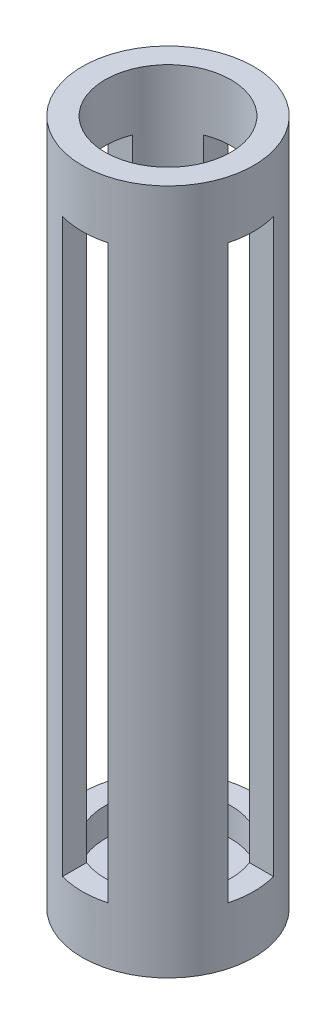
ISO-10303-21;
HEADER;
FILE_DESCRIPTION(('STEP AP214'),'2;1');
FILE_NAME('part.step','',(''),(''),'','','');
FILE_SCHEMA(('AUTOMOTIVE_DESIGN { 1 0 10303 214 1 1 1 1 }'));
ENDSEC;
DATA;
#1=APPLICATION_CONTEXT('core data for automotive mechanical design processes');
#2=APPLICATION_PROTOCOL_DEFINITION('international standard','automotive_design',2000,#1);
#3=PRODUCT_CONTEXT('',#1,'mechanical');
#4=PRODUCT('Part','Part','',(#3));
#5=PRODUCT_RELATED_PRODUCT_CATEGORY('part','',(#4));
#6=PRODUCT_DEFINITION_FORMATION('','',#4);
#7=PRODUCT_DEFINITION_CONTEXT('part definition',#1,'design');
#8=PRODUCT_DEFINITION('design','',#6,#7);
#9=PRODUCT_DEFINITION_SHAPE('','',#8);
#10=(LENGTH_UNIT() NAMED_UNIT(*) SI_UNIT(.MILLI.,.METRE.));
#11=(NAMED_UNIT(*) PLANE_ANGLE_UNIT() SI_UNIT($,.RADIAN.));
#12=(NAMED_UNIT(*) SI_UNIT($,.STERADIAN.) SOLID_ANGLE_UNIT());
#13=UNCERTAINTY_MEASURE_WITH_UNIT(LENGTH_MEASURE(1.E-05),#10,'distance_accuracy_value','');
#14=(GEOMETRIC_REPRESENTATION_CONTEXT(3) GLOBAL_UNCERTAINTY_ASSIGNED_CONTEXT((#13)) GLOBAL_UNIT_ASSIGNED_CONTEXT((#10,
#11,#12)) REPRESENTATION_CONTEXT('',''));
#15=CARTESIAN_POINT('',(0.,0.,0.));
#16=DIRECTION('',(0.,0.,1.));
#17=DIRECTION('',(1.,0.,0.));
#18=AXIS2_PLACEMENT_3D('',#15,#16,#17);
#19=CARTESIAN_POINT('',(0.,152.4,0.));
#20=DIRECTION('',(0.,-1.,0.));
#21=DIRECTION('',(0.,0.,-1.));
#22=AXIS2_PLACEMENT_3D('',#19,#20,#21);
#23=CYLINDRICAL_SURFACE('',#22,13.97);
#24=DIRECTION('',(0.,-1.,0.));
#25=VECTOR('',#24,1.);
#26=CARTESIAN_POINT('',(5.07999999999998,152.4,-13.0136274727687));
#27=LINE('',#26,#25);
#28=CARTESIAN_POINT('',(5.08000000000003,12.7,-13.0136274727687));
#29=VERTEX_POINT('',#28);
#30=CARTESIAN_POINT('',(5.07999999999998,139.7,-13.0136274727687));
#31=VERTEX_POINT('',#30);
#32=EDGE_CURVE('E11',#29,#31,#27,.F.);
#33=ORIENTED_EDGE('',*,*,#32,.F.);
#34=CARTESIAN_POINT('',(0.,12.7,0.));
#35=DIRECTION('',(0.,1.,0.));
#36=DIRECTION('',(-1.,0.,0.));
#37=AXIS2_PLACEMENT_3D('',#34,#35,#36);
#38=CIRCLE('',#37,13.97);
#39=CARTESIAN_POINT('',(-5.08000000000003,12.7,-13.0136274727687));
#40=VERTEX_POINT('',#39);
#41=EDGE_CURVE('E50',#29,#40,#38,.T.);
#42=ORIENTED_EDGE('',*,*,#41,.T.);
#43=DIRECTION('',(0.,-1.,0.));
#44=VECTOR('',#43,1.);
#45=CARTESIAN_POINT('',(-5.08000000000001,152.4,-13.0136274727687));
#46=LINE('',#45,#44);
#47=CARTESIAN_POINT('',(-5.08000000000001,139.7,-13.0136274727687));
#48=VERTEX_POINT('',#47);
#49=EDGE_CURVE('E444',#40,#48,#46,.F.);
#50=ORIENTED_EDGE('',*,*,#49,.T.);
#51=CARTESIAN_POINT('',(0.,139.7,0.));
#52=DIRECTION('',(0.,1.,0.));
#53=DIRECTION('',(0.,0.,1.));
#54=AXIS2_PLACEMENT_3D('',#51,#52,#53);
#55=CIRCLE('',#54,13.97);
#56=EDGE_CURVE('E434',#31,#48,#55,.T.);
#57=ORIENTED_EDGE('',*,*,#56,.F.);
#58=EDGE_LOOP('',(#33,#42,#50,#57));
#59=FACE_BOUND('',#58,.T.);
#60=DIRECTION('',(0.,-1.,0.));
#61=VECTOR('',#60,1.);
#62=CARTESIAN_POINT('',(5.07999999999998,152.4,13.0136274727687));
#63=LINE('',#62,#61);
#64=CARTESIAN_POINT('',(5.07999999999998,139.7,13.0136274727687));
#65=VERTEX_POINT('',#64);
#66=CARTESIAN_POINT('',(5.08000000000003,12.7,13.0136274727687));
#67=VERTEX_POINT('',#66);
#68=EDGE_CURVE('E442',#65,#67,#63,.T.);
#69=ORIENTED_EDGE('',*,*,#68,.F.);
#70=CARTESIAN_POINT('',(-5.08000000000001,139.7,13.0136274727687));
#71=VERTEX_POINT('',#70);
#72=EDGE_CURVE('E430',#71,#65,#55,.T.);
#73=ORIENTED_EDGE('',*,*,#72,.F.);
#74=DIRECTION('',(0.,-1.,0.));
#75=VECTOR('',#74,1.);
#76=CARTESIAN_POINT('',(-5.08000000000001,152.4,13.0136274727687));
#77=LINE('',#76,#75);
#78=CARTESIAN_POINT('',(-5.08000000000003,12.7,13.0136274727687));
#79=VERTEX_POINT('',#78);
#80=EDGE_CURVE('E433',#71,#79,#77,.T.);
#81=ORIENTED_EDGE('',*,*,#80,.T.);
#82=EDGE_CURVE('E438',#79,#67,#38,.T.);
#83=ORIENTED_EDGE('',*,*,#82,.T.);
#84=EDGE_LOOP('',(#69,#73,#81,#83));
#85=FACE_BOUND('',#84,.T.);
#86=DIRECTION('',(0.,-1.,0.));
#87=VECTOR('',#86,1.);
#88=CARTESIAN_POINT('',(13.0136274727687,152.4,-5.08));
#89=LINE('',#88,#87);
#90=CARTESIAN_POINT('',(13.0136274727687,139.7,-5.08));
#91=VERTEX_POINT('',#90);
#92=CARTESIAN_POINT('',(13.0136274727687,12.7,-5.08));
#93=VERTEX_POINT('',#92);
#94=EDGE_CURVE('E386',#91,#93,#89,.T.);
#95=ORIENTED_EDGE('',*,*,#94,.F.);
#96=CARTESIAN_POINT('',(0.,139.7,0.));
#97=DIRECTION('',(0.,1.,0.));
#98=DIRECTION('',(0.,0.,1.));
#99=AXIS2_PLACEMENT_3D('',#96,#97,#98);
#100=CIRCLE('',#99,13.97);
#101=CARTESIAN_POINT('',(13.0136274727687,139.7,5.08));
#102=VERTEX_POINT('',#101);
#103=EDGE_CURVE('E368',#102,#91,#100,.T.);
#104=ORIENTED_EDGE('',*,*,#103,.F.);
#105=DIRECTION('',(0.,-1.,0.));
#106=VECTOR('',#105,1.);
#107=CARTESIAN_POINT('',(13.0136274727687,152.4,5.08));
#108=LINE('',#107,#106);
#109=CARTESIAN_POINT('',(13.0136274727687,12.7,5.08));
#110=VERTEX_POINT('',#109);
#111=EDGE_CURVE('E373',#102,#110,#108,.T.);
#112=ORIENTED_EDGE('',*,*,#111,.T.);
#113=CARTESIAN_POINT('',(0.,12.7,0.));
#114=DIRECTION('',(0.,1.,0.));
#115=DIRECTION('',(0.,0.,1.));
#116=AXIS2_PLACEMENT_3D('',#113,#114,#115);
#117=CIRCLE('',#116,13.97);
#118=EDGE_CURVE('E381',#110,#93,#117,.T.);
#119=ORIENTED_EDGE('',*,*,#118,.T.);
#120=EDGE_LOOP('',(#95,#104,#112,#119));
#121=FACE_BOUND('',#120,.T.);
#122=DIRECTION('',(0.,-1.,0.));
#123=VECTOR('',#122,1.);
#124=CARTESIAN_POINT('',(-13.0136274727687,152.4,-5.08));
#125=LINE('',#124,#123);
#126=CARTESIAN_POINT('',(-13.0136274727687,12.7,-5.08));
#127=VERTEX_POINT('',#126);
#128=CARTESIAN_POINT('',(-13.0136274727687,139.7,-5.08));
#129=VERTEX_POINT('',#128);
#130=EDGE_CURVE('E382',#127,#129,#125,.F.);
#131=ORIENTED_EDGE('',*,*,#130,.F.);
#132=CARTESIAN_POINT('',(-13.0136274727687,12.7,5.08));
#133=VERTEX_POINT('',#132);
#134=EDGE_CURVE('E377',#127,#133,#117,.T.);
#135=ORIENTED_EDGE('',*,*,#134,.T.);
#136=DIRECTION('',(0.,-1.,0.));
#137=VECTOR('',#136,1.);
#138=CARTESIAN_POINT('',(-13.0136274727687,152.4,5.08));
#139=LINE('',#138,#137);
#140=CARTESIAN_POINT('',(-13.0136274727687,139.7,5.08));
#141=VERTEX_POINT('',#140);
#142=EDGE_CURVE('E369',#133,#141,#139,.F.);
#143=ORIENTED_EDGE('',*,*,#142,.T.);
#144=EDGE_CURVE('E365',#129,#141,#100,.T.);
#145=ORIENTED_EDGE('',*,*,#144,.F.);
#146=EDGE_LOOP('',(#131,#135,#143,#145));
#147=FACE_BOUND('',#146,.T.);
#148=CARTESIAN_POINT('',(0.,152.4,0.));
#149=DIRECTION('',(0.,1.,0.));
#150=DIRECTION('',(0.,0.,1.));
#151=AXIS2_PLACEMENT_3D('',#148,#149,#150);
#152=CIRCLE('',#151,13.97);
#153=CARTESIAN_POINT('',(0.,152.4,13.97));
#154=VERTEX_POINT('',#153);
#155=EDGE_CURVE('E393',#154,#154,#152,.T.);
#156=ORIENTED_EDGE('',*,*,#155,.T.);
#157=EDGE_LOOP('',(#156));
#158=FACE_BOUND('',#157,.T.);
#159=CARTESIAN_POINT('',(0.,6.35,0.));
#160=DIRECTION('',(0.,-1.,0.));
#161=DIRECTION('',(0.,0.,-1.));
#162=AXIS2_PLACEMENT_3D('',#159,#160,#161);
#163=CIRCLE('',#162,13.97);
#164=CARTESIAN_POINT('',(0.,6.35,-13.97));
#165=VERTEX_POINT('',#164);
#166=EDGE_CURVE('E389',#165,#165,#163,.T.);
#167=ORIENTED_EDGE('',*,*,#166,.T.);
#168=EDGE_LOOP('',(#167));
#169=FACE_BOUND('',#168,.T.);
#170=DIRECTION('',(0.,-1.,0.));
#171=VECTOR('',#170,1.);
#172=CARTESIAN_POINT('',(11.7877363247381,48.26,7.49734435239904));
#173=LINE('',#172,#171);
#174=CARTESIAN_POINT('',(11.7877363247381,48.26,7.49734435239904));
#175=VERTEX_POINT('',#174);
#176=CARTESIAN_POINT('',(11.7877363247381,45.72,7.49734435239904));
#177=VERTEX_POINT('',#176);
#178=EDGE_CURVE('E283',#175,#177,#173,.T.);
#179=ORIENTED_EDGE('',*,*,#178,.F.);
#180=CARTESIAN_POINT('',(0.,48.26,0.));
#181=DIRECTION('',(0.,-1.,0.));
#182=DIRECTION('',(0.,0.,-1.));
#183=AXIS2_PLACEMENT_3D('',#180,#181,#182);
#184=CIRCLE('',#183,13.97);
#185=CARTESIAN_POINT('',(6.08126850217283,48.26,12.5769262303824));
#186=VERTEX_POINT('',#185);
#187=EDGE_CURVE('E252',#175,#186,#184,.T.);
#188=ORIENTED_EDGE('',*,*,#187,.T.);
#189=DIRECTION('',(0.,-1.,0.));
#190=VECTOR('',#189,1.);
#191=CARTESIAN_POINT('',(6.08126850217283,48.26,12.5769262303824));
#192=LINE('',#191,#190);
#193=CARTESIAN_POINT('',(6.08126850217283,45.72,12.5769262303824));
#194=VERTEX_POINT('',#193);
#195=EDGE_CURVE('E268',#186,#194,#192,.T.);
#196=ORIENTED_EDGE('',*,*,#195,.T.);
#197=CARTESIAN_POINT('',(0.,45.72,0.));
#198=DIRECTION('',(0.,-1.,0.));
#199=DIRECTION('',(0.,0.,-1.));
#200=AXIS2_PLACEMENT_3D('',#197,#198,#199);
#201=CIRCLE('',#200,13.97);
#202=EDGE_CURVE('E247',#177,#194,#201,.T.);
#203=ORIENTED_EDGE('',*,*,#202,.F.);
#204=EDGE_LOOP('',(#179,#188,#196,#203));
#205=FACE_BOUND('',#204,.T.);
#206=DIRECTION('',(0.,-1.,0.));
#207=VECTOR('',#206,1.);
#208=CARTESIAN_POINT('',(-11.7877363247382,48.26,-7.49734435239896));
#209=LINE('',#208,#207);
#210=CARTESIAN_POINT('',(-11.7877363247382,48.26,-7.49734435239896));
#211=VERTEX_POINT('',#210);
#212=CARTESIAN_POINT('',(-11.7877363247382,45.72,-7.49734435239896));
#213=VERTEX_POINT('',#212);
#214=EDGE_CURVE('E57',#211,#213,#209,.T.);
#215=ORIENTED_EDGE('',*,*,#214,.F.);
#216=CARTESIAN_POINT('',(0.,48.26,0.));
#217=DIRECTION('',(0.,-1.,0.));
#218=DIRECTION('',(0.,0.,-1.));
#219=AXIS2_PLACEMENT_3D('',#216,#217,#218);
#220=CIRCLE('',#219,13.97);
#221=CARTESIAN_POINT('',(-6.08126850217292,48.26,-12.5769262303823));
#222=VERTEX_POINT('',#221);
#223=EDGE_CURVE('E61',#211,#222,#220,.T.);
#224=ORIENTED_EDGE('',*,*,#223,.T.);
#225=DIRECTION('',(0.,-1.,0.));
#226=VECTOR('',#225,1.);
#227=CARTESIAN_POINT('',(-6.08126850217292,48.26,-12.5769262303823));
#228=LINE('',#227,#226);
#229=CARTESIAN_POINT('',(-6.08126850217292,45.72,-12.5769262303823));
#230=VERTEX_POINT('',#229);
#231=EDGE_CURVE('E214',#222,#230,#228,.T.);
#232=ORIENTED_EDGE('',*,*,#231,.T.);
#233=CARTESIAN_POINT('',(0.,45.72,0.));
#234=DIRECTION('',(0.,-1.,0.));
#235=DIRECTION('',(0.,0.,-1.));
#236=AXIS2_PLACEMENT_3D('',#233,#234,#235);
#237=CIRCLE('',#236,13.97);
#238=EDGE_CURVE('E233',#213,#230,#237,.T.);
#239=ORIENTED_EDGE('',*,*,#238,.F.);
#240=EDGE_LOOP('',(#215,#224,#232,#239));
#241=FACE_BOUND('',#240,.T.);
#242=ADVANCED_FACE('F41',(#59,#85,#121,#147,#158,#169,#205,#241),#23,.F.);
#243=CARTESIAN_POINT('',(0.,152.4,0.));
#244=DIRECTION('',(0.,-1.,0.));
#245=DIRECTION('',(0.,0.,-1.));
#246=AXIS2_PLACEMENT_3D('',#243,#244,#245);
#247=CYLINDRICAL_SURFACE('',#246,19.05);
#248=CARTESIAN_POINT('',(0.,12.7,0.));
#249=DIRECTION('',(0.,1.,0.));
#250=DIRECTION('',(-1.,0.,0.));
#251=AXIS2_PLACEMENT_3D('',#248,#249,#250);
#252=CIRCLE('',#251,19.05);
#253=CARTESIAN_POINT('',(5.08000000000003,12.7,-18.3601770143972));
#254=VERTEX_POINT('',#253);
#255=CARTESIAN_POINT('',(-5.08000000000003,12.7,-18.3601770143972));
#256=VERTEX_POINT('',#255);
#257=EDGE_CURVE('E334',#254,#256,#252,.T.);
#258=ORIENTED_EDGE('',*,*,#257,.F.);
#259=DIRECTION('',(0.,-1.,0.));
#260=VECTOR('',#259,1.);
#261=CARTESIAN_POINT('',(5.07999999999998,152.4,-18.3601770143972));
#262=LINE('',#261,#260);
#263=CARTESIAN_POINT('',(5.07999999999998,139.7,-18.3601770143972));
#264=VERTEX_POINT('',#263);
#265=EDGE_CURVE('E338',#254,#264,#262,.F.);
#266=ORIENTED_EDGE('',*,*,#265,.T.);
#267=CARTESIAN_POINT('',(0.,139.7,0.));
#268=DIRECTION('',(0.,1.,0.));
#269=DIRECTION('',(0.,0.,1.));
#270=AXIS2_PLACEMENT_3D('',#267,#268,#269);
#271=CIRCLE('',#270,19.05);
#272=CARTESIAN_POINT('',(-5.08000000000001,139.7,-18.3601770143972));
#273=VERTEX_POINT('',#272);
#274=EDGE_CURVE('E326',#264,#273,#271,.T.);
#275=ORIENTED_EDGE('',*,*,#274,.T.);
#276=DIRECTION('',(0.,-1.,0.));
#277=VECTOR('',#276,1.);
#278=CARTESIAN_POINT('',(-5.08000000000001,152.4,-18.3601770143972));
#279=LINE('',#278,#277);
#280=EDGE_CURVE('E327',#256,#273,#279,.F.);
#281=ORIENTED_EDGE('',*,*,#280,.F.);
#282=EDGE_LOOP('',(#258,#266,#275,#281));
#283=FACE_BOUND('',#282,.T.);
#284=CARTESIAN_POINT('',(0.,12.7,0.));
#285=DIRECTION('',(0.,1.,0.));
#286=DIRECTION('',(0.,0.,1.));
#287=AXIS2_PLACEMENT_3D('',#284,#285,#286);
#288=CIRCLE('',#287,19.05);
#289=CARTESIAN_POINT('',(18.3601770143972,12.7,5.08));
#290=VERTEX_POINT('',#289);
#291=CARTESIAN_POINT('',(18.3601770143972,12.7,-5.08));
#292=VERTEX_POINT('',#291);
#293=EDGE_CURVE('E409',#290,#292,#288,.T.);
#294=ORIENTED_EDGE('',*,*,#293,.F.);
#295=DIRECTION('',(0.,-1.,0.));
#296=VECTOR('',#295,1.);
#297=CARTESIAN_POINT('',(18.3601770143972,152.4,5.08));
#298=LINE('',#297,#296);
#299=CARTESIAN_POINT('',(18.3601770143972,139.7,5.08));
#300=VERTEX_POINT('',#299);
#301=EDGE_CURVE('E426',#300,#290,#298,.T.);
#302=ORIENTED_EDGE('',*,*,#301,.F.);
#303=CARTESIAN_POINT('',(0.,139.7,0.));
#304=DIRECTION('',(0.,1.,0.));
#305=DIRECTION('',(0.,0.,1.));
#306=AXIS2_PLACEMENT_3D('',#303,#304,#305);
#307=CIRCLE('',#306,19.05);
#308=CARTESIAN_POINT('',(18.3601770143972,139.7,-5.08));
#309=VERTEX_POINT('',#308);
#310=EDGE_CURVE('E402',#300,#309,#307,.T.);
#311=ORIENTED_EDGE('',*,*,#310,.T.);
#312=DIRECTION('',(0.,-1.,0.));
#313=VECTOR('',#312,1.);
#314=CARTESIAN_POINT('',(18.3601770143972,152.4,-5.08));
#315=LINE('',#314,#313);
#316=EDGE_CURVE('E413',#309,#292,#315,.T.);
#317=ORIENTED_EDGE('',*,*,#316,.T.);
#318=EDGE_LOOP('',(#294,#302,#311,#317));
#319=FACE_BOUND('',#318,.T.);
#320=CARTESIAN_POINT('',(0.,0.,0.));
#321=DIRECTION('',(0.,1.,0.));
#322=DIRECTION('',(0.,0.,1.));
#323=AXIS2_PLACEMENT_3D('',#320,#321,#322);
#324=CIRCLE('',#323,19.05);
#325=CARTESIAN_POINT('',(0.,0.,19.05));
#326=VERTEX_POINT('',#325);
#327=EDGE_CURVE('E397',#326,#326,#324,.T.);
#328=ORIENTED_EDGE('',*,*,#327,.T.);
#329=EDGE_LOOP('',(#328));
#330=FACE_BOUND('',#329,.T.);
#331=CARTESIAN_POINT('',(0.,152.4,0.));
#332=DIRECTION('',(0.,1.,0.));
#333=DIRECTION('',(0.,0.,1.));
#334=AXIS2_PLACEMENT_3D('',#331,#332,#333);
#335=CIRCLE('',#334,19.05);
#336=CARTESIAN_POINT('',(0.,152.4,19.05));
#337=VERTEX_POINT('',#336);
#338=EDGE_CURVE('E398',#337,#337,#335,.T.);
#339=ORIENTED_EDGE('',*,*,#338,.F.);
#340=EDGE_LOOP('',(#339));
#341=FACE_BOUND('',#340,.T.);
#342=DIRECTION('',(0.,-1.,0.));
#343=VECTOR('',#342,1.);
#344=CARTESIAN_POINT('',(-18.3601770143972,152.4,-5.08));
#345=LINE('',#344,#343);
#346=CARTESIAN_POINT('',(-18.3601770143972,12.7,-5.08));
#347=VERTEX_POINT('',#346);
#348=CARTESIAN_POINT('',(-18.3601770143972,139.7,-5.08));
#349=VERTEX_POINT('',#348);
#350=EDGE_CURVE('E422',#347,#349,#345,.F.);
#351=ORIENTED_EDGE('',*,*,#350,.T.);
#352=CARTESIAN_POINT('',(-18.3601770143972,139.7,5.08));
#353=VERTEX_POINT('',#352);
#354=EDGE_CURVE('E410',#349,#353,#307,.T.);
#355=ORIENTED_EDGE('',*,*,#354,.T.);
#356=DIRECTION('',(0.,-1.,0.));
#357=VECTOR('',#356,1.);
#358=CARTESIAN_POINT('',(-18.3601770143972,152.4,5.08));
#359=LINE('',#358,#357);
#360=CARTESIAN_POINT('',(-18.3601770143972,12.7,5.08));
#361=VERTEX_POINT('',#360);
#362=EDGE_CURVE('E418',#361,#353,#359,.F.);
#363=ORIENTED_EDGE('',*,*,#362,.F.);
#364=EDGE_CURVE('E414',#347,#361,#288,.T.);
#365=ORIENTED_EDGE('',*,*,#364,.F.);
#366=EDGE_LOOP('',(#351,#355,#363,#365));
#367=FACE_BOUND('',#366,.T.);
#368=CARTESIAN_POINT('',(-5.08000000000003,12.7,18.3601770143972));
#369=VERTEX_POINT('',#368);
#370=CARTESIAN_POINT('',(5.08000000000003,12.7,18.3601770143972));
#371=VERTEX_POINT('',#370);
#372=EDGE_CURVE('E335',#369,#371,#252,.T.);
#373=ORIENTED_EDGE('',*,*,#372,.F.);
#374=DIRECTION('',(0.,-1.,0.));
#375=VECTOR('',#374,1.);
#376=CARTESIAN_POINT('',(-5.08000000000001,152.4,18.3601770143972));
#377=LINE('',#376,#375);
#378=CARTESIAN_POINT('',(-5.08000000000001,139.7,18.3601770143972));
#379=VERTEX_POINT('',#378);
#380=EDGE_CURVE('E331',#379,#369,#377,.T.);
#381=ORIENTED_EDGE('',*,*,#380,.F.);
#382=CARTESIAN_POINT('',(5.07999999999998,139.7,18.3601770143972));
#383=VERTEX_POINT('',#382);
#384=EDGE_CURVE('E323',#379,#383,#271,.T.);
#385=ORIENTED_EDGE('',*,*,#384,.T.);
#386=DIRECTION('',(0.,-1.,0.));
#387=VECTOR('',#386,1.);
#388=CARTESIAN_POINT('',(5.07999999999998,152.4,18.3601770143972));
#389=LINE('',#388,#387);
#390=EDGE_CURVE('E342',#383,#371,#389,.T.);
#391=ORIENTED_EDGE('',*,*,#390,.T.);
#392=EDGE_LOOP('',(#373,#381,#385,#391));
#393=FACE_BOUND('',#392,.T.);
#394=ADVANCED_FACE('F43',(#283,#319,#330,#341,#367,#393),#247,.T.);
#395=CARTESIAN_POINT('',(0.,152.4,0.));
#396=DIRECTION('',(0.,1.,0.));
#397=DIRECTION('',(0.,0.,1.));
#398=AXIS2_PLACEMENT_3D('',#395,#396,#397);
#399=PLANE('',#398);
#400=ORIENTED_EDGE('',*,*,#338,.T.);
#401=EDGE_LOOP('',(#400));
#402=FACE_BOUND('',#401,.T.);
#403=ORIENTED_EDGE('',*,*,#155,.F.);
#404=EDGE_LOOP('',(#403));
#405=FACE_BOUND('',#404,.T.);
#406=ADVANCED_FACE('F586',(#402,#405),#399,.T.);
#407=CARTESIAN_POINT('',(0.,0.,0.));
#408=DIRECTION('',(0.,1.,0.));
#409=DIRECTION('',(0.,0.,1.));
#410=AXIS2_PLACEMENT_3D('',#407,#408,#409);
#411=PLANE('',#410);
#412=CARTESIAN_POINT('',(0.,0.,0.));
#413=DIRECTION('',(0.,1.,0.));
#414=DIRECTION('',(0.,0.,1.));
#415=AXIS2_PLACEMENT_3D('',#412,#413,#414);
#416=CIRCLE('',#415,6.35);
#417=CARTESIAN_POINT('',(0.,0.,6.35));
#418=VERTEX_POINT('',#417);
#419=EDGE_CURVE('E296',#418,#418,#416,.T.);
#420=ORIENTED_EDGE('',*,*,#419,.T.);
#421=EDGE_LOOP('',(#420));
#422=FACE_BOUND('',#421,.T.);
#423=ORIENTED_EDGE('',*,*,#327,.F.);
#424=EDGE_LOOP('',(#423));
#425=FACE_BOUND('',#424,.T.);
#426=ADVANCED_FACE('F583',(#422,#425),#411,.F.);
#427=CARTESIAN_POINT('',(0.,6.35,0.));
#428=DIRECTION('',(0.,-1.,0.));
#429=DIRECTION('',(0.,0.,-1.));
#430=AXIS2_PLACEMENT_3D('',#427,#428,#429);
#431=PLANE('',#430);
#432=CARTESIAN_POINT('',(0.,6.35,0.));
#433=DIRECTION('',(0.,1.,0.));
#434=DIRECTION('',(0.,0.,1.));
#435=AXIS2_PLACEMENT_3D('',#432,#433,#434);
#436=CIRCLE('',#435,6.35);
#437=CARTESIAN_POINT('',(0.,6.35,6.35));
#438=VERTEX_POINT('',#437);
#439=EDGE_CURVE('E287',#438,#438,#436,.T.);
#440=ORIENTED_EDGE('',*,*,#439,.F.);
#441=EDGE_LOOP('',(#440));
#442=FACE_BOUND('',#441,.T.);
#443=ORIENTED_EDGE('',*,*,#166,.F.);
#444=EDGE_LOOP('',(#443));
#445=FACE_BOUND('',#444,.T.);
#446=ADVANCED_FACE('F581',(#442,#445),#431,.F.);
#447=CARTESIAN_POINT('',(-19.05,139.7,0.));
#448=DIRECTION('',(0.,1.,0.));
#449=DIRECTION('',(0.,0.,1.));
#450=AXIS2_PLACEMENT_3D('',#447,#448,#449);
#451=PLANE('',#450);
#452=ORIENTED_EDGE('',*,*,#144,.T.);
#453=DIRECTION('',(1.,0.,0.));
#454=VECTOR('',#453,1.);
#455=CARTESIAN_POINT('',(-19.05,139.7,5.08));
#456=LINE('',#455,#454);
#457=EDGE_CURVE('E357',#353,#141,#456,.T.);
#458=ORIENTED_EDGE('',*,*,#457,.F.);
#459=ORIENTED_EDGE('',*,*,#354,.F.);
#460=DIRECTION('',(1.,0.,0.));
#461=VECTOR('',#460,1.);
#462=CARTESIAN_POINT('',(-19.05,139.7,-5.08));
#463=LINE('',#462,#461);
#464=EDGE_CURVE('E362',#349,#129,#463,.T.);
#465=ORIENTED_EDGE('',*,*,#464,.T.);
#466=EDGE_LOOP('',(#452,#458,#459,#465));
#467=FACE_BOUND('',#466,.T.);
#468=ADVANCED_FACE('F495',(#467),#451,.F.);
#469=CARTESIAN_POINT('',(-19.05,0.,5.08));
#470=DIRECTION('',(0.,0.,-1.));
#471=DIRECTION('',(-1.,0.,0.));
#472=AXIS2_PLACEMENT_3D('',#469,#470,#471);
#473=PLANE('',#472);
#474=DIRECTION('',(1.,0.,0.));
#475=VECTOR('',#474,1.);
#476=CARTESIAN_POINT('',(-19.05,12.7,5.08));
#477=LINE('',#476,#475);
#478=EDGE_CURVE('E352',#361,#133,#477,.T.);
#479=ORIENTED_EDGE('',*,*,#478,.F.);
#480=ORIENTED_EDGE('',*,*,#362,.T.);
#481=ORIENTED_EDGE('',*,*,#457,.T.);
#482=ORIENTED_EDGE('',*,*,#142,.F.);
#483=EDGE_LOOP('',(#479,#480,#481,#482));
#484=FACE_BOUND('',#483,.T.);
#485=ADVANCED_FACE('F491',(#484),#473,.T.);
#486=CARTESIAN_POINT('',(-19.05,12.7,0.));
#487=DIRECTION('',(0.,1.,0.));
#488=DIRECTION('',(0.,0.,1.));
#489=AXIS2_PLACEMENT_3D('',#486,#487,#488);
#490=PLANE('',#489);
#491=DIRECTION('',(1.,0.,0.));
#492=VECTOR('',#491,1.);
#493=CARTESIAN_POINT('',(-19.05,12.7,-5.08));
#494=LINE('',#493,#492);
#495=EDGE_CURVE('E351',#347,#127,#494,.T.);
#496=ORIENTED_EDGE('',*,*,#495,.F.);
#497=ORIENTED_EDGE('',*,*,#364,.T.);
#498=ORIENTED_EDGE('',*,*,#478,.T.);
#499=ORIENTED_EDGE('',*,*,#134,.F.);
#500=EDGE_LOOP('',(#496,#497,#498,#499));
#501=FACE_BOUND('',#500,.T.);
#502=ADVANCED_FACE('F486',(#501),#490,.T.);
#503=CARTESIAN_POINT('',(-19.05,0.,-5.08));
#504=DIRECTION('',(0.,0.,-1.));
#505=DIRECTION('',(-1.,0.,0.));
#506=AXIS2_PLACEMENT_3D('',#503,#504,#505);
#507=PLANE('',#506);
#508=ORIENTED_EDGE('',*,*,#130,.T.);
#509=ORIENTED_EDGE('',*,*,#464,.F.);
#510=ORIENTED_EDGE('',*,*,#350,.F.);
#511=ORIENTED_EDGE('',*,*,#495,.T.);
#512=EDGE_LOOP('',(#508,#509,#510,#511));
#513=FACE_BOUND('',#512,.T.);
#514=ADVANCED_FACE('F497',(#513),#507,.F.);
#515=ORIENTED_EDGE('',*,*,#94,.T.);
#516=EDGE_CURVE('E347',#93,#292,#494,.T.);
#517=ORIENTED_EDGE('',*,*,#516,.T.);
#518=ORIENTED_EDGE('',*,*,#316,.F.);
#519=EDGE_CURVE('E346',#91,#309,#463,.T.);
#520=ORIENTED_EDGE('',*,*,#519,.F.);
#521=EDGE_LOOP('',(#515,#517,#518,#520));
#522=FACE_BOUND('',#521,.T.);
#523=ADVANCED_FACE('F569',(#522),#507,.F.);
#524=EDGE_CURVE('E353',#110,#290,#477,.T.);
#525=ORIENTED_EDGE('',*,*,#524,.T.);
#526=ORIENTED_EDGE('',*,*,#293,.T.);
#527=ORIENTED_EDGE('',*,*,#516,.F.);
#528=ORIENTED_EDGE('',*,*,#118,.F.);
#529=EDGE_LOOP('',(#525,#526,#527,#528));
#530=FACE_BOUND('',#529,.T.);
#531=ADVANCED_FACE('F565',(#530),#490,.T.);
#532=EDGE_CURVE('E358',#102,#300,#456,.T.);
#533=ORIENTED_EDGE('',*,*,#532,.T.);
#534=ORIENTED_EDGE('',*,*,#301,.T.);
#535=ORIENTED_EDGE('',*,*,#524,.F.);
#536=ORIENTED_EDGE('',*,*,#111,.F.);
#537=EDGE_LOOP('',(#533,#534,#535,#536));
#538=FACE_BOUND('',#537,.T.);
#539=ADVANCED_FACE('F568',(#538),#473,.T.);
#540=ORIENTED_EDGE('',*,*,#103,.T.);
#541=ORIENTED_EDGE('',*,*,#519,.T.);
#542=ORIENTED_EDGE('',*,*,#310,.F.);
#543=ORIENTED_EDGE('',*,*,#532,.F.);
#544=EDGE_LOOP('',(#540,#541,#542,#543));
#545=FACE_BOUND('',#544,.T.);
#546=ADVANCED_FACE('F573',(#545),#451,.F.);
#547=CARTESIAN_POINT('',(0.,139.7,-19.05));
#548=DIRECTION('',(0.,1.,0.));
#549=DIRECTION('',(0.,0.,1.));
#550=AXIS2_PLACEMENT_3D('',#547,#548,#549);
#551=PLANE('',#550);
#552=ORIENTED_EDGE('',*,*,#384,.F.);
#553=DIRECTION('',(0.,0.,1.));
#554=VECTOR('',#553,1.);
#555=CARTESIAN_POINT('',(-5.08000000000002,139.7,-19.05));
#556=LINE('',#555,#554);
#557=EDGE_CURVE('E315',#71,#379,#556,.T.);
#558=ORIENTED_EDGE('',*,*,#557,.F.);
#559=ORIENTED_EDGE('',*,*,#72,.T.);
#560=DIRECTION('',(0.,0.,1.));
#561=VECTOR('',#560,1.);
#562=CARTESIAN_POINT('',(5.07999999999998,139.7,-19.05));
#563=LINE('',#562,#561);
#564=EDGE_CURVE('E300',#65,#383,#563,.T.);
#565=ORIENTED_EDGE('',*,*,#564,.T.);
#566=EDGE_LOOP('',(#552,#558,#559,#565));
#567=FACE_BOUND('',#566,.T.);
#568=ADVANCED_FACE('F557',(#567),#551,.F.);
#569=CARTESIAN_POINT('',(-5.08000000000003,0.,-19.05));
#570=DIRECTION('',(1.,0.,0.));
#571=DIRECTION('',(0.,1.,0.));
#572=AXIS2_PLACEMENT_3D('',#569,#570,#571);
#573=PLANE('',#572);
#574=ORIENTED_EDGE('',*,*,#380,.T.);
#575=DIRECTION('',(0.,0.,1.));
#576=VECTOR('',#575,1.);
#577=CARTESIAN_POINT('',(-5.08000000000003,12.7,-19.05));
#578=LINE('',#577,#576);
#579=EDGE_CURVE('E310',#79,#369,#578,.T.);
#580=ORIENTED_EDGE('',*,*,#579,.F.);
#581=ORIENTED_EDGE('',*,*,#80,.F.);
#582=ORIENTED_EDGE('',*,*,#557,.T.);
#583=EDGE_LOOP('',(#574,#580,#581,#582));
#584=FACE_BOUND('',#583,.T.);
#585=ADVANCED_FACE('F552',(#584),#573,.T.);
#586=CARTESIAN_POINT('',(0.,12.7,-19.05));
#587=DIRECTION('',(0.,1.,0.));
#588=DIRECTION('',(-1.,0.,0.));
#589=AXIS2_PLACEMENT_3D('',#586,#587,#588);
#590=PLANE('',#589);
#591=ORIENTED_EDGE('',*,*,#372,.T.);
#592=DIRECTION('',(0.,0.,1.));
#593=VECTOR('',#592,1.);
#594=CARTESIAN_POINT('',(5.08000000000003,12.7,-19.05));
#595=LINE('',#594,#593);
#596=EDGE_CURVE('E304',#67,#371,#595,.T.);
#597=ORIENTED_EDGE('',*,*,#596,.F.);
#598=ORIENTED_EDGE('',*,*,#82,.F.);
#599=ORIENTED_EDGE('',*,*,#579,.T.);
#600=EDGE_LOOP('',(#591,#597,#598,#599));
#601=FACE_BOUND('',#600,.T.);
#602=ADVANCED_FACE('F548',(#601),#590,.T.);
#603=CARTESIAN_POINT('',(5.08000000000004,0.,-19.05));
#604=DIRECTION('',(1.,0.,0.));
#605=DIRECTION('',(0.,1.,0.));
#606=AXIS2_PLACEMENT_3D('',#603,#604,#605);
#607=PLANE('',#606);
#608=ORIENTED_EDGE('',*,*,#564,.F.);
#609=ORIENTED_EDGE('',*,*,#68,.T.);
#610=ORIENTED_EDGE('',*,*,#596,.T.);
#611=ORIENTED_EDGE('',*,*,#390,.F.);
#612=EDGE_LOOP('',(#608,#609,#610,#611));
#613=FACE_BOUND('',#612,.T.);
#614=ADVANCED_FACE('F551',(#613),#607,.F.);
#615=EDGE_CURVE('E308',#254,#29,#595,.T.);
#616=ORIENTED_EDGE('',*,*,#615,.T.);
#617=ORIENTED_EDGE('',*,*,#32,.T.);
#618=EDGE_CURVE('E319',#264,#31,#563,.T.);
#619=ORIENTED_EDGE('',*,*,#618,.F.);
#620=ORIENTED_EDGE('',*,*,#265,.F.);
#621=EDGE_LOOP('',(#616,#617,#619,#620));
#622=FACE_BOUND('',#621,.T.);
#623=ADVANCED_FACE('F563',(#622),#607,.F.);
#624=ORIENTED_EDGE('',*,*,#257,.T.);
#625=EDGE_CURVE('E309',#256,#40,#578,.T.);
#626=ORIENTED_EDGE('',*,*,#625,.T.);
#627=ORIENTED_EDGE('',*,*,#41,.F.);
#628=ORIENTED_EDGE('',*,*,#615,.F.);
#629=EDGE_LOOP('',(#624,#626,#627,#628));
#630=FACE_BOUND('',#629,.T.);
#631=ADVANCED_FACE('F554',(#630),#590,.T.);
#632=ORIENTED_EDGE('',*,*,#280,.T.);
#633=EDGE_CURVE('E314',#273,#48,#556,.T.);
#634=ORIENTED_EDGE('',*,*,#633,.T.);
#635=ORIENTED_EDGE('',*,*,#49,.F.);
#636=ORIENTED_EDGE('',*,*,#625,.F.);
#637=EDGE_LOOP('',(#632,#634,#635,#636));
#638=FACE_BOUND('',#637,.T.);
#639=ADVANCED_FACE('F459',(#638),#573,.T.);
#640=ORIENTED_EDGE('',*,*,#618,.T.);
#641=ORIENTED_EDGE('',*,*,#56,.T.);
#642=ORIENTED_EDGE('',*,*,#633,.F.);
#643=ORIENTED_EDGE('',*,*,#274,.F.);
#644=EDGE_LOOP('',(#640,#641,#642,#643));
#645=FACE_BOUND('',#644,.T.);
#646=ADVANCED_FACE('F455',(#645),#551,.F.);
#647=CARTESIAN_POINT('',(0.,0.,0.));
#648=DIRECTION('',(0.,1.,0.));
#649=DIRECTION('',(0.,0.,1.));
#650=AXIS2_PLACEMENT_3D('',#647,#648,#649);
#651=CYLINDRICAL_SURFACE('',#650,6.35);
#652=ORIENTED_EDGE('',*,*,#419,.F.);
#653=EDGE_LOOP('',(#652));
#654=FACE_BOUND('',#653,.T.);
#655=ORIENTED_EDGE('',*,*,#439,.T.);
#656=EDGE_LOOP('',(#655));
#657=FACE_BOUND('',#656,.T.);
#658=ADVANCED_FACE('F540',(#654,#657),#651,.F.);
#659=CARTESIAN_POINT('',(11.7877363247381,48.26,7.49734435239904));
#660=DIRECTION('',(0.536674613629136,0.,-0.843789285951189));
#661=DIRECTION('',(-0.843789285951189,0.,-0.536674613629136));
#662=AXIS2_PLACEMENT_3D('',#659,#660,#661);
#663=PLANE('',#662);
#664=DIRECTION('',(0.843789285951189,0.,0.536674613629136));
#665=VECTOR('',#664,1.);
#666=CARTESIAN_POINT('',(11.7877363247381,45.72,7.49734435239904));
#667=LINE('',#666,#665);
#668=CARTESIAN_POINT('',(8.57289914526408,45.72,5.45261407447203));
#669=VERTEX_POINT('',#668);
#670=EDGE_CURVE('E256',#669,#177,#667,.T.);
#671=ORIENTED_EDGE('',*,*,#670,.F.);
#672=DIRECTION('',(0.,-1.,0.));
#673=VECTOR('',#672,1.);
#674=CARTESIAN_POINT('',(8.57289914526408,48.26,5.45261407447203));
#675=LINE('',#674,#673);
#676=CARTESIAN_POINT('',(8.57289914526408,48.26,5.45261407447203));
#677=VERTEX_POINT('',#676);
#678=EDGE_CURVE('E288',#677,#669,#675,.T.);
#679=ORIENTED_EDGE('',*,*,#678,.F.);
#680=DIRECTION('',(0.843789285951189,0.,0.536674613629136));
#681=VECTOR('',#680,1.);
#682=CARTESIAN_POINT('',(11.7877363247381,48.26,7.49734435239904));
#683=LINE('',#682,#681);
#684=EDGE_CURVE('E264',#677,#175,#683,.T.);
#685=ORIENTED_EDGE('',*,*,#684,.T.);
#686=ORIENTED_EDGE('',*,*,#178,.T.);
#687=EDGE_LOOP('',(#671,#679,#685,#686));
#688=FACE_BOUND('',#687,.T.);
#689=ADVANCED_FACE('F517',(#688),#663,.T.);
#690=CARTESIAN_POINT('',(0.,48.26,0.));
#691=DIRECTION('',(0.,-1.,0.));
#692=DIRECTION('',(0.,0.,-1.));
#693=AXIS2_PLACEMENT_3D('',#690,#691,#692);
#694=CYLINDRICAL_SURFACE('',#693,10.16);
#695=CARTESIAN_POINT('',(0.,45.72,0.));
#696=DIRECTION('',(0.,1.,0.));
#697=DIRECTION('',(0.,0.,-1.));
#698=AXIS2_PLACEMENT_3D('',#695,#696,#697);
#699=CIRCLE('',#698,10.16);
#700=CARTESIAN_POINT('',(4.42274072885297,45.72,9.1468554402781));
#701=VERTEX_POINT('',#700);
#702=EDGE_CURVE('E276',#701,#669,#699,.T.);
#703=ORIENTED_EDGE('',*,*,#702,.F.);
#704=DIRECTION('',(0.,-1.,0.));
#705=VECTOR('',#704,1.);
#706=CARTESIAN_POINT('',(4.42274072885297,48.26,9.1468554402781));
#707=LINE('',#706,#705);
#708=CARTESIAN_POINT('',(4.42274072885297,48.26,9.1468554402781));
#709=VERTEX_POINT('',#708);
#710=EDGE_CURVE('E291',#709,#701,#707,.T.);
#711=ORIENTED_EDGE('',*,*,#710,.F.);
#712=CARTESIAN_POINT('',(0.,48.26,0.));
#713=DIRECTION('',(0.,1.,0.));
#714=DIRECTION('',(0.,0.,-1.));
#715=AXIS2_PLACEMENT_3D('',#712,#713,#714);
#716=CIRCLE('',#715,10.16);
#717=EDGE_CURVE('E260',#709,#677,#716,.T.);
#718=ORIENTED_EDGE('',*,*,#717,.T.);
#719=ORIENTED_EDGE('',*,*,#678,.T.);
#720=EDGE_LOOP('',(#703,#711,#718,#719));
#721=FACE_BOUND('',#720,.T.);
#722=ADVANCED_FACE('F520',(#721),#694,.F.);
#723=CARTESIAN_POINT('',(6.08126850217283,48.26,12.5769262303824));
#724=DIRECTION('',(-0.900281047271467,0.,0.435309126855607));
#725=DIRECTION('',(0.435309126855607,0.,0.900281047271467));
#726=AXIS2_PLACEMENT_3D('',#723,#724,#725);
#727=PLANE('',#726);
#728=DIRECTION('',(-0.435309126855607,0.,-0.900281047271467));
#729=VECTOR('',#728,1.);
#730=CARTESIAN_POINT('',(6.08126850217283,45.72,12.5769262303824));
#731=LINE('',#730,#729);
#732=EDGE_CURVE('E272',#194,#701,#731,.T.);
#733=ORIENTED_EDGE('',*,*,#732,.F.);
#734=ORIENTED_EDGE('',*,*,#195,.F.);
#735=DIRECTION('',(-0.435309126855607,0.,-0.900281047271467));
#736=VECTOR('',#735,1.);
#737=CARTESIAN_POINT('',(6.08126850217283,48.26,12.5769262303824));
#738=LINE('',#737,#736);
#739=EDGE_CURVE('E255',#186,#709,#738,.T.);
#740=ORIENTED_EDGE('',*,*,#739,.T.);
#741=ORIENTED_EDGE('',*,*,#710,.T.);
#742=EDGE_LOOP('',(#733,#734,#740,#741));
#743=FACE_BOUND('',#742,.T.);
#744=ADVANCED_FACE('F523',(#743),#727,.T.);
#745=CARTESIAN_POINT('',(0.,48.26,0.));
#746=DIRECTION('',(0.,-1.,0.));
#747=DIRECTION('',(0.,0.,-1.));
#748=AXIS2_PLACEMENT_3D('',#745,#746,#747);
#749=PLANE('',#748);
#750=ORIENTED_EDGE('',*,*,#187,.F.);
#751=ORIENTED_EDGE('',*,*,#684,.F.);
#752=ORIENTED_EDGE('',*,*,#717,.F.);
#753=ORIENTED_EDGE('',*,*,#739,.F.);
#754=EDGE_LOOP('',(#750,#751,#752,#753));
#755=FACE_BOUND('',#754,.T.);
#756=ADVANCED_FACE('F515',(#755),#749,.F.);
#757=CARTESIAN_POINT('',(0.,45.72,0.));
#758=DIRECTION('',(0.,-1.,0.));
#759=DIRECTION('',(0.,0.,-1.));
#760=AXIS2_PLACEMENT_3D('',#757,#758,#759);
#761=PLANE('',#760);
#762=ORIENTED_EDGE('',*,*,#202,.T.);
#763=ORIENTED_EDGE('',*,*,#732,.T.);
#764=ORIENTED_EDGE('',*,*,#702,.T.);
#765=ORIENTED_EDGE('',*,*,#670,.T.);
#766=EDGE_LOOP('',(#762,#763,#764,#765));
#767=FACE_BOUND('',#766,.T.);
#768=ADVANCED_FACE('F525',(#767),#761,.T.);
#769=CARTESIAN_POINT('',(-11.7877363247382,48.26,-7.49734435239896));
#770=DIRECTION('',(-0.53667461362913,0.,0.843789285951193));
#771=DIRECTION('',(0.843789285951193,0.,0.53667461362913));
#772=AXIS2_PLACEMENT_3D('',#769,#770,#771);
#773=PLANE('',#772);
#774=DIRECTION('',(-0.843789285951193,0.,-0.53667461362913));
#775=VECTOR('',#774,1.);
#776=CARTESIAN_POINT('',(-11.7877363247382,45.72,-7.49734435239896));
#777=LINE('',#776,#775);
#778=CARTESIAN_POINT('',(-8.57289914526412,45.72,-5.45261407447197));
#779=VERTEX_POINT('',#778);
#780=EDGE_CURVE('E228',#779,#213,#777,.T.);
#781=ORIENTED_EDGE('',*,*,#780,.F.);
#782=DIRECTION('',(0.,-1.,0.));
#783=VECTOR('',#782,1.);
#784=CARTESIAN_POINT('',(-8.57289914526412,48.26,-5.45261407447197));
#785=LINE('',#784,#783);
#786=CARTESIAN_POINT('',(-8.57289914526412,48.26,-5.45261407447197));
#787=VERTEX_POINT('',#786);
#788=EDGE_CURVE('E213',#787,#779,#785,.T.);
#789=ORIENTED_EDGE('',*,*,#788,.F.);
#790=DIRECTION('',(-0.843789285951193,0.,-0.53667461362913));
#791=VECTOR('',#790,1.);
#792=CARTESIAN_POINT('',(-11.7877363247382,48.26,-7.49734435239896));
#793=LINE('',#792,#791);
#794=EDGE_CURVE('E221',#787,#211,#793,.T.);
#795=ORIENTED_EDGE('',*,*,#794,.T.);
#796=ORIENTED_EDGE('',*,*,#214,.T.);
#797=EDGE_LOOP('',(#781,#789,#795,#796));
#798=FACE_BOUND('',#797,.T.);
#799=ADVANCED_FACE('F527',(#798),#773,.T.);
#800=CARTESIAN_POINT('',(0.,48.26,0.));
#801=DIRECTION('',(0.,-1.,0.));
#802=DIRECTION('',(0.,0.,-1.));
#803=AXIS2_PLACEMENT_3D('',#800,#801,#802);
#804=CYLINDRICAL_SURFACE('',#803,10.16);
#805=CARTESIAN_POINT('',(0.,45.72,0.));
#806=DIRECTION('',(0.,1.,0.));
#807=DIRECTION('',(0.,0.,-1.));
#808=AXIS2_PLACEMENT_3D('',#805,#806,#807);
#809=CIRCLE('',#808,10.16);
#810=CARTESIAN_POINT('',(-4.42274072885304,45.72,-9.14685544027807));
#811=VERTEX_POINT('',#810);
#812=EDGE_CURVE('E207',#811,#779,#809,.T.);
#813=ORIENTED_EDGE('',*,*,#812,.F.);
#814=DIRECTION('',(0.,-1.,0.));
#815=VECTOR('',#814,1.);
#816=CARTESIAN_POINT('',(-4.42274072885304,48.26,-9.14685544027807));
#817=LINE('',#816,#815);
#818=CARTESIAN_POINT('',(-4.42274072885304,48.26,-9.14685544027807));
#819=VERTEX_POINT('',#818);
#820=EDGE_CURVE('E201',#819,#811,#817,.T.);
#821=ORIENTED_EDGE('',*,*,#820,.F.);
#822=CARTESIAN_POINT('',(0.,48.26,0.));
#823=DIRECTION('',(0.,1.,0.));
#824=DIRECTION('',(0.,0.,-1.));
#825=AXIS2_PLACEMENT_3D('',#822,#823,#824);
#826=CIRCLE('',#825,10.16);
#827=EDGE_CURVE('E204',#819,#787,#826,.T.);
#828=ORIENTED_EDGE('',*,*,#827,.T.);
#829=ORIENTED_EDGE('',*,*,#788,.T.);
#830=EDGE_LOOP('',(#813,#821,#828,#829));
#831=FACE_BOUND('',#830,.T.);
#832=ADVANCED_FACE('F203',(#831),#804,.F.);
#833=CARTESIAN_POINT('',(-6.08126850217292,48.26,-12.5769262303823));
#834=DIRECTION('',(0.900281047271464,0.,-0.435309126855613));
#835=DIRECTION('',(-0.435309126855613,0.,-0.900281047271464));
#836=AXIS2_PLACEMENT_3D('',#833,#834,#835);
#837=PLANE('',#836);
#838=DIRECTION('',(0.435309126855613,0.,0.900281047271464));
#839=VECTOR('',#838,1.);
#840=CARTESIAN_POINT('',(-6.08126850217292,45.72,-12.5769262303823));
#841=LINE('',#840,#839);
#842=EDGE_CURVE('E237',#230,#811,#841,.T.);
#843=ORIENTED_EDGE('',*,*,#842,.F.);
#844=ORIENTED_EDGE('',*,*,#231,.F.);
#845=DIRECTION('',(0.435309126855613,0.,0.900281047271464));
#846=VECTOR('',#845,1.);
#847=CARTESIAN_POINT('',(-6.08126850217292,48.26,-12.5769262303823));
#848=LINE('',#847,#846);
#849=EDGE_CURVE('E219',#222,#819,#848,.T.);
#850=ORIENTED_EDGE('',*,*,#849,.T.);
#851=ORIENTED_EDGE('',*,*,#820,.T.);
#852=EDGE_LOOP('',(#843,#844,#850,#851));
#853=FACE_BOUND('',#852,.T.);
#854=ADVANCED_FACE('F224',(#853),#837,.T.);
#855=CARTESIAN_POINT('',(0.,48.26,0.));
#856=DIRECTION('',(0.,-1.,0.));
#857=DIRECTION('',(0.,0.,-1.));
#858=AXIS2_PLACEMENT_3D('',#855,#856,#857);
#859=PLANE('',#858);
#860=ORIENTED_EDGE('',*,*,#223,.F.);
#861=ORIENTED_EDGE('',*,*,#794,.F.);
#862=ORIENTED_EDGE('',*,*,#827,.F.);
#863=ORIENTED_EDGE('',*,*,#849,.F.);
#864=EDGE_LOOP('',(#860,#861,#862,#863));
#865=FACE_BOUND('',#864,.T.);
#866=ADVANCED_FACE('F218',(#865),#859,.F.);
#867=CARTESIAN_POINT('',(0.,45.72,0.));
#868=DIRECTION('',(0.,-1.,0.));
#869=DIRECTION('',(0.,0.,-1.));
#870=AXIS2_PLACEMENT_3D('',#867,#868,#869);
#871=PLANE('',#870);
#872=ORIENTED_EDGE('',*,*,#238,.T.);
#873=ORIENTED_EDGE('',*,*,#842,.T.);
#874=ORIENTED_EDGE('',*,*,#812,.T.);
#875=ORIENTED_EDGE('',*,*,#780,.T.);
#876=EDGE_LOOP('',(#872,#873,#874,#875));
#877=FACE_BOUND('',#876,.T.);
#878=ADVANCED_FACE('F721',(#877),#871,.T.);
#879=CLOSED_SHELL('',(#242,#394,#406,#426,#446,#468,#485,#502,#514,#523,#531,#539,#546,#568,
#585,#602,#614,#623,#631,#639,#646,#658,#689,#722,#744,#756,#768,#799,#832,#854,#866,#878));
#880=MANIFOLD_SOLID_BREP('B2',#879);
#881=ADVANCED_BREP_SHAPE_REPRESENTATION('',(#18,#880),#14);
#882=SHAPE_DEFINITION_REPRESENTATION(#9,#881);
ENDSEC;
END-ISO-10303-21;
